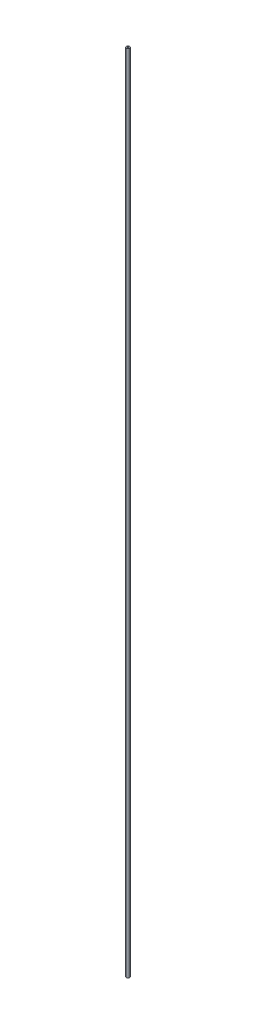
ISO-10303-21;
HEADER;
FILE_DESCRIPTION(('STEP AP214'),'2;1');
FILE_NAME('part.step','',(''),(''),'','','');
FILE_SCHEMA(('AUTOMOTIVE_DESIGN { 1 0 10303 214 1 1 1 1 }'));
ENDSEC;
DATA;
#1=APPLICATION_CONTEXT('core data for automotive mechanical design processes');
#2=APPLICATION_PROTOCOL_DEFINITION('international standard','automotive_design',2000,#1);
#3=PRODUCT_CONTEXT('',#1,'mechanical');
#4=PRODUCT('Part','Part','',(#3));
#5=PRODUCT_RELATED_PRODUCT_CATEGORY('part','',(#4));
#6=PRODUCT_DEFINITION_FORMATION('','',#4);
#7=PRODUCT_DEFINITION_CONTEXT('part definition',#1,'design');
#8=PRODUCT_DEFINITION('design','',#6,#7);
#9=PRODUCT_DEFINITION_SHAPE('','',#8);
#10=(LENGTH_UNIT() NAMED_UNIT(*) SI_UNIT(.MILLI.,.METRE.));
#11=(NAMED_UNIT(*) PLANE_ANGLE_UNIT() SI_UNIT($,.RADIAN.));
#12=(NAMED_UNIT(*) SI_UNIT($,.STERADIAN.) SOLID_ANGLE_UNIT());
#13=UNCERTAINTY_MEASURE_WITH_UNIT(LENGTH_MEASURE(1.E-05),#10,'distance_accuracy_value','');
#14=(GEOMETRIC_REPRESENTATION_CONTEXT(3) GLOBAL_UNCERTAINTY_ASSIGNED_CONTEXT((#13)) GLOBAL_UNIT_ASSIGNED_CONTEXT((#10,
#11,#12)) REPRESENTATION_CONTEXT('',''));
#15=CARTESIAN_POINT('',(0.,0.,0.));
#16=DIRECTION('',(0.,0.,1.));
#17=DIRECTION('',(1.,0.,0.));
#18=AXIS2_PLACEMENT_3D('',#15,#16,#17);
#19=CARTESIAN_POINT('',(0.,762.,0.));
#20=DIRECTION('',(0.,1.,0.));
#21=DIRECTION('',(0.,0.,1.));
#22=AXIS2_PLACEMENT_3D('',#19,#20,#21);
#23=PLANE('',#22);
#24=CARTESIAN_POINT('',(0.,762.,0.));
#25=DIRECTION('',(0.,1.,0.));
#26=DIRECTION('',(0.,0.,1.));
#27=AXIS2_PLACEMENT_3D('',#24,#25,#26);
#28=CIRCLE('',#27,3.175);
#29=CARTESIAN_POINT('',(0.,762.,3.175));
#30=VERTEX_POINT('',#29);
#31=EDGE_CURVE('E10',#30,#30,#28,.T.);
#32=ORIENTED_EDGE('',*,*,#31,.T.);
#33=EDGE_LOOP('',(#32));
#34=FACE_BOUND('',#33,.T.);
#35=CARTESIAN_POINT('',(0.,762.,0.));
#36=DIRECTION('',(0.,1.,0.));
#37=DIRECTION('',(0.,0.,1.));
#38=AXIS2_PLACEMENT_3D('',#35,#36,#37);
#39=CIRCLE('',#38,1.524);
#40=CARTESIAN_POINT('',(0.,762.,1.524));
#41=VERTEX_POINT('',#40);
#42=EDGE_CURVE('E44',#41,#41,#39,.T.);
#43=ORIENTED_EDGE('',*,*,#42,.F.);
#44=EDGE_LOOP('',(#43));
#45=FACE_BOUND('',#44,.T.);
#46=ADVANCED_FACE('F33',(#34,#45),#23,.T.);
#47=CARTESIAN_POINT('',(0.,-762.,0.));
#48=DIRECTION('',(0.,1.,0.));
#49=DIRECTION('',(0.,0.,1.));
#50=AXIS2_PLACEMENT_3D('',#47,#48,#49);
#51=PLANE('',#50);
#52=CARTESIAN_POINT('',(0.,-762.,0.));
#53=DIRECTION('',(0.,1.,0.));
#54=DIRECTION('',(0.,0.,1.));
#55=AXIS2_PLACEMENT_3D('',#52,#53,#54);
#56=CIRCLE('',#55,3.175);
#57=CARTESIAN_POINT('',(0.,-762.,3.175));
#58=VERTEX_POINT('',#57);
#59=EDGE_CURVE('E37',#58,#58,#56,.T.);
#60=ORIENTED_EDGE('',*,*,#59,.F.);
#61=EDGE_LOOP('',(#60));
#62=FACE_BOUND('',#61,.T.);
#63=CARTESIAN_POINT('',(0.,-762.,0.));
#64=DIRECTION('',(0.,1.,0.));
#65=DIRECTION('',(0.,0.,1.));
#66=AXIS2_PLACEMENT_3D('',#63,#64,#65);
#67=CIRCLE('',#66,1.524);
#68=CARTESIAN_POINT('',(0.,-762.,1.524));
#69=VERTEX_POINT('',#68);
#70=EDGE_CURVE('E46',#69,#69,#67,.T.);
#71=ORIENTED_EDGE('',*,*,#70,.T.);
#72=EDGE_LOOP('',(#71));
#73=FACE_BOUND('',#72,.T.);
#74=ADVANCED_FACE('F56',(#62,#73),#51,.F.);
#75=CARTESIAN_POINT('',(0.,762.,0.));
#76=DIRECTION('',(0.,-1.,0.));
#77=DIRECTION('',(0.,0.,-1.));
#78=AXIS2_PLACEMENT_3D('',#75,#76,#77);
#79=CYLINDRICAL_SURFACE('',#78,3.175);
#80=ORIENTED_EDGE('',*,*,#31,.F.);
#81=EDGE_LOOP('',(#80));
#82=FACE_BOUND('',#81,.T.);
#83=ORIENTED_EDGE('',*,*,#59,.T.);
#84=EDGE_LOOP('',(#83));
#85=FACE_BOUND('',#84,.T.);
#86=ADVANCED_FACE('F35',(#82,#85),#79,.T.);
#87=CARTESIAN_POINT('',(0.,762.,0.));
#88=DIRECTION('',(0.,-1.,0.));
#89=DIRECTION('',(0.,0.,-1.));
#90=AXIS2_PLACEMENT_3D('',#87,#88,#89);
#91=CYLINDRICAL_SURFACE('',#90,1.524);
#92=ORIENTED_EDGE('',*,*,#42,.T.);
#93=EDGE_LOOP('',(#92));
#94=FACE_BOUND('',#93,.T.);
#95=ORIENTED_EDGE('',*,*,#70,.F.);
#96=EDGE_LOOP('',(#95));
#97=FACE_BOUND('',#96,.T.);
#98=ADVANCED_FACE('F52',(#94,#97),#91,.F.);
#99=CLOSED_SHELL('',(#46,#74,#86,#98));
#100=MANIFOLD_SOLID_BREP('B2',#99);
#101=ADVANCED_BREP_SHAPE_REPRESENTATION('',(#18,#100),#14);
#102=SHAPE_DEFINITION_REPRESENTATION(#9,#101);
ENDSEC;
END-ISO-10303-21;
